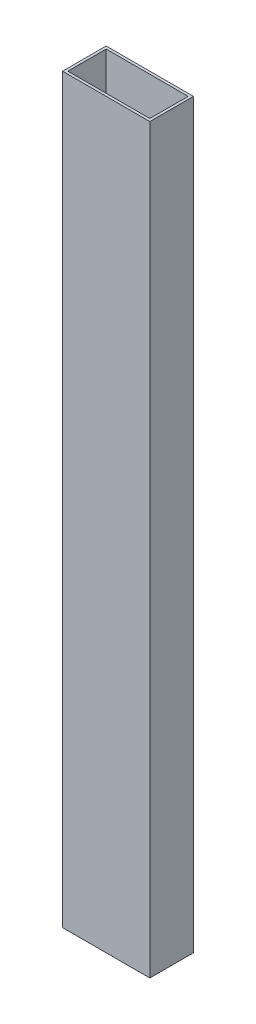
ISO-10303-21;
HEADER;
FILE_DESCRIPTION(('STEP AP214'),'2;1');
FILE_NAME('part.step','',(''),(''),'','','');
FILE_SCHEMA(('AUTOMOTIVE_DESIGN { 1 0 10303 214 1 1 1 1 }'));
ENDSEC;
DATA;
#1=APPLICATION_CONTEXT('core data for automotive mechanical design processes');
#2=APPLICATION_PROTOCOL_DEFINITION('international standard','automotive_design',2000,#1);
#3=PRODUCT_CONTEXT('',#1,'mechanical');
#4=PRODUCT('Part','Part','',(#3));
#5=PRODUCT_RELATED_PRODUCT_CATEGORY('part','',(#4));
#6=PRODUCT_DEFINITION_FORMATION('','',#4);
#7=PRODUCT_DEFINITION_CONTEXT('part definition',#1,'design');
#8=PRODUCT_DEFINITION('design','',#6,#7);
#9=PRODUCT_DEFINITION_SHAPE('','',#8);
#10=(LENGTH_UNIT() NAMED_UNIT(*) SI_UNIT(.MILLI.,.METRE.));
#11=(NAMED_UNIT(*) PLANE_ANGLE_UNIT() SI_UNIT($,.RADIAN.));
#12=(NAMED_UNIT(*) SI_UNIT($,.STERADIAN.) SOLID_ANGLE_UNIT());
#13=UNCERTAINTY_MEASURE_WITH_UNIT(LENGTH_MEASURE(1.E-05),#10,'distance_accuracy_value','');
#14=(GEOMETRIC_REPRESENTATION_CONTEXT(3) GLOBAL_UNCERTAINTY_ASSIGNED_CONTEXT((#13)) GLOBAL_UNIT_ASSIGNED_CONTEXT((#10,
#11,#12)) REPRESENTATION_CONTEXT('',''));
#15=CARTESIAN_POINT('',(0.,0.,0.));
#16=DIRECTION('',(0.,0.,1.));
#17=DIRECTION('',(1.,0.,0.));
#18=AXIS2_PLACEMENT_3D('',#15,#16,#17);
#19=CARTESIAN_POINT('',(0.,432.054,0.));
#20=DIRECTION('',(0.,1.,0.));
#21=DIRECTION('',(0.,0.,1.));
#22=AXIS2_PLACEMENT_3D('',#19,#20,#21);
#23=PLANE('',#22);
#24=DIRECTION('',(0.,0.,1.));
#25=VECTOR('',#24,1.);
#26=CARTESIAN_POINT('',(-21.4647887323944,432.054,-13.0577464788733));
#27=LINE('',#26,#25);
#28=CARTESIAN_POINT('',(-21.4647887323944,432.054,-13.0577464788733));
#29=VERTEX_POINT('',#28);
#30=CARTESIAN_POINT('',(-21.4647887323943,432.054,12.3422535211267));
#31=VERTEX_POINT('',#30);
#32=EDGE_CURVE('E153',#29,#31,#27,.T.);
#33=ORIENTED_EDGE('',*,*,#32,.T.);
#34=DIRECTION('',(1.,0.,0.));
#35=VECTOR('',#34,1.);
#36=CARTESIAN_POINT('',(-21.4647887323943,432.054,12.3422535211267));
#37=LINE('',#36,#35);
#38=CARTESIAN_POINT('',(29.3352112676057,432.054,12.3422535211267));
#39=VERTEX_POINT('',#38);
#40=EDGE_CURVE('E157',#31,#39,#37,.T.);
#41=ORIENTED_EDGE('',*,*,#40,.T.);
#42=DIRECTION('',(0.,0.,-1.));
#43=VECTOR('',#42,1.);
#44=CARTESIAN_POINT('',(29.3352112676057,432.054,-13.0577464788733));
#45=LINE('',#44,#43);
#46=CARTESIAN_POINT('',(29.3352112676057,432.054,-13.0577464788733));
#47=VERTEX_POINT('',#46);
#48=EDGE_CURVE('E161',#39,#47,#45,.T.);
#49=ORIENTED_EDGE('',*,*,#48,.T.);
#50=DIRECTION('',(-1.,0.,0.));
#51=VECTOR('',#50,1.);
#52=CARTESIAN_POINT('',(-21.4647887323944,432.054,-13.0577464788733));
#53=LINE('',#52,#51);
#54=EDGE_CURVE('E164',#47,#29,#53,.T.);
#55=ORIENTED_EDGE('',*,*,#54,.T.);
#56=EDGE_LOOP('',(#33,#41,#49,#55));
#57=FACE_BOUND('',#56,.T.);
#58=DIRECTION('',(1.,0.,0.));
#59=VECTOR('',#58,1.);
#60=CARTESIAN_POINT('',(-19.9407887323943,432.054,10.8182535211267));
#61=LINE('',#60,#59);
#62=CARTESIAN_POINT('',(-19.9407887323943,432.054,10.8182535211267));
#63=VERTEX_POINT('',#62);
#64=CARTESIAN_POINT('',(27.8112112676056,432.054,10.8182535211267));
#65=VERTEX_POINT('',#64);
#66=EDGE_CURVE('E114',#63,#65,#61,.T.);
#67=ORIENTED_EDGE('',*,*,#66,.F.);
#68=DIRECTION('',(0.,0.,1.));
#69=VECTOR('',#68,1.);
#70=CARTESIAN_POINT('',(-19.9407887323943,432.054,-11.5337464788733));
#71=LINE('',#70,#69);
#72=CARTESIAN_POINT('',(-19.9407887323943,432.054,-11.5337464788733));
#73=VERTEX_POINT('',#72);
#74=EDGE_CURVE('E105',#73,#63,#71,.T.);
#75=ORIENTED_EDGE('',*,*,#74,.F.);
#76=DIRECTION('',(-1.,0.,0.));
#77=VECTOR('',#76,1.);
#78=CARTESIAN_POINT('',(-19.9407887323943,432.054,-11.5337464788733));
#79=LINE('',#78,#77);
#80=CARTESIAN_POINT('',(27.8112112676056,432.054,-11.5337464788733));
#81=VERTEX_POINT('',#80);
#82=EDGE_CURVE('E131',#81,#73,#79,.T.);
#83=ORIENTED_EDGE('',*,*,#82,.F.);
#84=DIRECTION('',(0.,0.,-1.));
#85=VECTOR('',#84,1.);
#86=CARTESIAN_POINT('',(27.8112112676056,432.054,-11.5337464788733));
#87=LINE('',#86,#85);
#88=EDGE_CURVE('E127',#65,#81,#87,.T.);
#89=ORIENTED_EDGE('',*,*,#88,.F.);
#90=EDGE_LOOP('',(#67,#75,#83,#89));
#91=FACE_BOUND('',#90,.T.);
#92=ADVANCED_FACE('F39',(#57,#91),#23,.T.);
#93=CARTESIAN_POINT('',(0.,0.,0.));
#94=DIRECTION('',(0.,1.,0.));
#95=DIRECTION('',(0.,0.,1.));
#96=AXIS2_PLACEMENT_3D('',#93,#94,#95);
#97=PLANE('',#96);
#98=DIRECTION('',(0.,0.,1.));
#99=VECTOR('',#98,1.);
#100=CARTESIAN_POINT('',(-21.4647887323944,0.,-13.0577464788733));
#101=LINE('',#100,#99);
#102=CARTESIAN_POINT('',(-21.4647887323944,0.,-13.0577464788733));
#103=VERTEX_POINT('',#102);
#104=CARTESIAN_POINT('',(-21.4647887323943,0.,12.3422535211267));
#105=VERTEX_POINT('',#104);
#106=EDGE_CURVE('E123',#103,#105,#101,.T.);
#107=ORIENTED_EDGE('',*,*,#106,.F.);
#108=DIRECTION('',(-1.,0.,0.));
#109=VECTOR('',#108,1.);
#110=CARTESIAN_POINT('',(-21.4647887323944,0.,-13.0577464788733));
#111=LINE('',#110,#109);
#112=CARTESIAN_POINT('',(29.3352112676057,0.,-13.0577464788733));
#113=VERTEX_POINT('',#112);
#114=EDGE_CURVE('E158',#113,#103,#111,.T.);
#115=ORIENTED_EDGE('',*,*,#114,.F.);
#116=DIRECTION('',(0.,0.,-1.));
#117=VECTOR('',#116,1.);
#118=CARTESIAN_POINT('',(29.3352112676057,0.,-13.0577464788733));
#119=LINE('',#118,#117);
#120=CARTESIAN_POINT('',(29.3352112676057,0.,12.3422535211267));
#121=VERTEX_POINT('',#120);
#122=EDGE_CURVE('E174',#121,#113,#119,.T.);
#123=ORIENTED_EDGE('',*,*,#122,.F.);
#124=DIRECTION('',(1.,0.,0.));
#125=VECTOR('',#124,1.);
#126=CARTESIAN_POINT('',(-21.4647887323943,0.,12.3422535211267));
#127=LINE('',#126,#125);
#128=EDGE_CURVE('E171',#105,#121,#127,.T.);
#129=ORIENTED_EDGE('',*,*,#128,.F.);
#130=EDGE_LOOP('',(#107,#115,#123,#129));
#131=FACE_BOUND('',#130,.T.);
#132=DIRECTION('',(0.,0.,1.));
#133=VECTOR('',#132,1.);
#134=CARTESIAN_POINT('',(-19.9407887323943,0.,-11.5337464788733));
#135=LINE('',#134,#133);
#136=CARTESIAN_POINT('',(-19.9407887323943,0.,-11.5337464788733));
#137=VERTEX_POINT('',#136);
#138=CARTESIAN_POINT('',(-19.9407887323943,0.,10.8182535211267));
#139=VERTEX_POINT('',#138);
#140=EDGE_CURVE('E63',#137,#139,#135,.T.);
#141=ORIENTED_EDGE('',*,*,#140,.T.);
#142=DIRECTION('',(1.,0.,0.));
#143=VECTOR('',#142,1.);
#144=CARTESIAN_POINT('',(-19.9407887323943,0.,10.8182535211267));
#145=LINE('',#144,#143);
#146=CARTESIAN_POINT('',(27.8112112676056,0.,10.8182535211267));
#147=VERTEX_POINT('',#146);
#148=EDGE_CURVE('E121',#139,#147,#145,.T.);
#149=ORIENTED_EDGE('',*,*,#148,.T.);
#150=DIRECTION('',(0.,0.,-1.));
#151=VECTOR('',#150,1.);
#152=CARTESIAN_POINT('',(27.8112112676056,0.,-11.5337464788733));
#153=LINE('',#152,#151);
#154=CARTESIAN_POINT('',(27.8112112676056,0.,-11.5337464788733));
#155=VERTEX_POINT('',#154);
#156=EDGE_CURVE('E140',#147,#155,#153,.T.);
#157=ORIENTED_EDGE('',*,*,#156,.T.);
#158=DIRECTION('',(-1.,0.,0.));
#159=VECTOR('',#158,1.);
#160=CARTESIAN_POINT('',(-19.9407887323943,0.,-11.5337464788733));
#161=LINE('',#160,#159);
#162=EDGE_CURVE('E115',#155,#137,#161,.T.);
#163=ORIENTED_EDGE('',*,*,#162,.T.);
#164=EDGE_LOOP('',(#141,#149,#157,#163));
#165=FACE_BOUND('',#164,.T.);
#166=ADVANCED_FACE('F197',(#131,#165),#97,.F.);
#167=CARTESIAN_POINT('',(-21.4647887323944,432.054,-13.0577464788733));
#168=DIRECTION('',(1.,0.,0.));
#169=DIRECTION('',(0.,0.,-1.));
#170=AXIS2_PLACEMENT_3D('',#167,#168,#169);
#171=PLANE('',#170);
#172=ORIENTED_EDGE('',*,*,#106,.T.);
#173=DIRECTION('',(0.,-1.,0.));
#174=VECTOR('',#173,1.);
#175=CARTESIAN_POINT('',(-21.4647887323943,432.054,12.3422535211267));
#176=LINE('',#175,#174);
#177=EDGE_CURVE('E11',#31,#105,#176,.T.);
#178=ORIENTED_EDGE('',*,*,#177,.F.);
#179=ORIENTED_EDGE('',*,*,#32,.F.);
#180=DIRECTION('',(0.,-1.,0.));
#181=VECTOR('',#180,1.);
#182=CARTESIAN_POINT('',(-21.4647887323944,432.054,-13.0577464788733));
#183=LINE('',#182,#181);
#184=EDGE_CURVE('E167',#29,#103,#183,.T.);
#185=ORIENTED_EDGE('',*,*,#184,.T.);
#186=EDGE_LOOP('',(#172,#178,#179,#185));
#187=FACE_BOUND('',#186,.T.);
#188=ADVANCED_FACE('F41',(#187),#171,.F.);
#189=CARTESIAN_POINT('',(-21.4647887323943,432.054,12.3422535211267));
#190=DIRECTION('',(0.,0.,-1.));
#191=DIRECTION('',(-1.,0.,0.));
#192=AXIS2_PLACEMENT_3D('',#189,#190,#191);
#193=PLANE('',#192);
#194=ORIENTED_EDGE('',*,*,#128,.T.);
#195=DIRECTION('',(0.,-1.,0.));
#196=VECTOR('',#195,1.);
#197=CARTESIAN_POINT('',(29.3352112676057,432.054,12.3422535211267));
#198=LINE('',#197,#196);
#199=EDGE_CURVE('E48',#39,#121,#198,.T.);
#200=ORIENTED_EDGE('',*,*,#199,.F.);
#201=ORIENTED_EDGE('',*,*,#40,.F.);
#202=ORIENTED_EDGE('',*,*,#177,.T.);
#203=EDGE_LOOP('',(#194,#200,#201,#202));
#204=FACE_BOUND('',#203,.T.);
#205=ADVANCED_FACE('F207',(#204),#193,.F.);
#206=CARTESIAN_POINT('',(29.3352112676057,432.054,-13.0577464788733));
#207=DIRECTION('',(-1.,0.,0.));
#208=DIRECTION('',(0.,0.,1.));
#209=AXIS2_PLACEMENT_3D('',#206,#207,#208);
#210=PLANE('',#209);
#211=ORIENTED_EDGE('',*,*,#122,.T.);
#212=DIRECTION('',(0.,-1.,0.));
#213=VECTOR('',#212,1.);
#214=CARTESIAN_POINT('',(29.3352112676057,432.054,-13.0577464788733));
#215=LINE('',#214,#213);
#216=EDGE_CURVE('E182',#47,#113,#215,.T.);
#217=ORIENTED_EDGE('',*,*,#216,.F.);
#218=ORIENTED_EDGE('',*,*,#48,.F.);
#219=ORIENTED_EDGE('',*,*,#199,.T.);
#220=EDGE_LOOP('',(#211,#217,#218,#219));
#221=FACE_BOUND('',#220,.T.);
#222=ADVANCED_FACE('F191',(#221),#210,.F.);
#223=CARTESIAN_POINT('',(-21.4647887323944,432.054,-13.0577464788733));
#224=DIRECTION('',(0.,0.,1.));
#225=DIRECTION('',(1.,0.,0.));
#226=AXIS2_PLACEMENT_3D('',#223,#224,#225);
#227=PLANE('',#226);
#228=ORIENTED_EDGE('',*,*,#114,.T.);
#229=ORIENTED_EDGE('',*,*,#184,.F.);
#230=ORIENTED_EDGE('',*,*,#54,.F.);
#231=ORIENTED_EDGE('',*,*,#216,.T.);
#232=EDGE_LOOP('',(#228,#229,#230,#231));
#233=FACE_BOUND('',#232,.T.);
#234=ADVANCED_FACE('F201',(#233),#227,.F.);
#235=CARTESIAN_POINT('',(-19.9407887323943,432.054,-11.5337464788733));
#236=DIRECTION('',(1.,0.,0.));
#237=DIRECTION('',(0.,0.,-1.));
#238=AXIS2_PLACEMENT_3D('',#235,#236,#237);
#239=PLANE('',#238);
#240=ORIENTED_EDGE('',*,*,#140,.F.);
#241=DIRECTION('',(0.,-1.,0.));
#242=VECTOR('',#241,1.);
#243=CARTESIAN_POINT('',(-19.9407887323943,432.054,-11.5337464788733));
#244=LINE('',#243,#242);
#245=EDGE_CURVE('E109',#73,#137,#244,.T.);
#246=ORIENTED_EDGE('',*,*,#245,.F.);
#247=ORIENTED_EDGE('',*,*,#74,.T.);
#248=DIRECTION('',(0.,-1.,0.));
#249=VECTOR('',#248,1.);
#250=CARTESIAN_POINT('',(-19.9407887323943,432.054,10.8182535211267));
#251=LINE('',#250,#249);
#252=EDGE_CURVE('E108',#63,#139,#251,.T.);
#253=ORIENTED_EDGE('',*,*,#252,.T.);
#254=EDGE_LOOP('',(#240,#246,#247,#253));
#255=FACE_BOUND('',#254,.T.);
#256=ADVANCED_FACE('F107',(#255),#239,.T.);
#257=CARTESIAN_POINT('',(-19.9407887323943,432.054,10.8182535211267));
#258=DIRECTION('',(0.,0.,-1.));
#259=DIRECTION('',(-1.,0.,0.));
#260=AXIS2_PLACEMENT_3D('',#257,#258,#259);
#261=PLANE('',#260);
#262=ORIENTED_EDGE('',*,*,#148,.F.);
#263=ORIENTED_EDGE('',*,*,#252,.F.);
#264=ORIENTED_EDGE('',*,*,#66,.T.);
#265=DIRECTION('',(0.,-1.,0.));
#266=VECTOR('',#265,1.);
#267=CARTESIAN_POINT('',(27.8112112676056,432.054,10.8182535211267));
#268=LINE('',#267,#266);
#269=EDGE_CURVE('E124',#65,#147,#268,.T.);
#270=ORIENTED_EDGE('',*,*,#269,.T.);
#271=EDGE_LOOP('',(#262,#263,#264,#270));
#272=FACE_BOUND('',#271,.T.);
#273=ADVANCED_FACE('F118',(#272),#261,.T.);
#274=CARTESIAN_POINT('',(27.8112112676056,432.054,-11.5337464788733));
#275=DIRECTION('',(-1.,0.,0.));
#276=DIRECTION('',(0.,0.,1.));
#277=AXIS2_PLACEMENT_3D('',#274,#275,#276);
#278=PLANE('',#277);
#279=ORIENTED_EDGE('',*,*,#156,.F.);
#280=ORIENTED_EDGE('',*,*,#269,.F.);
#281=ORIENTED_EDGE('',*,*,#88,.T.);
#282=DIRECTION('',(0.,-1.,0.));
#283=VECTOR('',#282,1.);
#284=CARTESIAN_POINT('',(27.8112112676056,432.054,-11.5337464788733));
#285=LINE('',#284,#283);
#286=EDGE_CURVE('E55',#81,#155,#285,.T.);
#287=ORIENTED_EDGE('',*,*,#286,.T.);
#288=EDGE_LOOP('',(#279,#280,#281,#287));
#289=FACE_BOUND('',#288,.T.);
#290=ADVANCED_FACE('F230',(#289),#278,.T.);
#291=CARTESIAN_POINT('',(-19.9407887323943,432.054,-11.5337464788733));
#292=DIRECTION('',(0.,0.,1.));
#293=DIRECTION('',(1.,0.,0.));
#294=AXIS2_PLACEMENT_3D('',#291,#292,#293);
#295=PLANE('',#294);
#296=ORIENTED_EDGE('',*,*,#162,.F.);
#297=ORIENTED_EDGE('',*,*,#286,.F.);
#298=ORIENTED_EDGE('',*,*,#82,.T.);
#299=ORIENTED_EDGE('',*,*,#245,.T.);
#300=EDGE_LOOP('',(#296,#297,#298,#299));
#301=FACE_BOUND('',#300,.T.);
#302=ADVANCED_FACE('F234',(#301),#295,.T.);
#303=CLOSED_SHELL('',(#92,#166,#188,#205,#222,#234,#256,#273,#290,#302));
#304=MANIFOLD_SOLID_BREP('B2',#303);
#305=ADVANCED_BREP_SHAPE_REPRESENTATION('',(#18,#304),#14);
#306=SHAPE_DEFINITION_REPRESENTATION(#9,#305);
ENDSEC;
END-ISO-10303-21;
